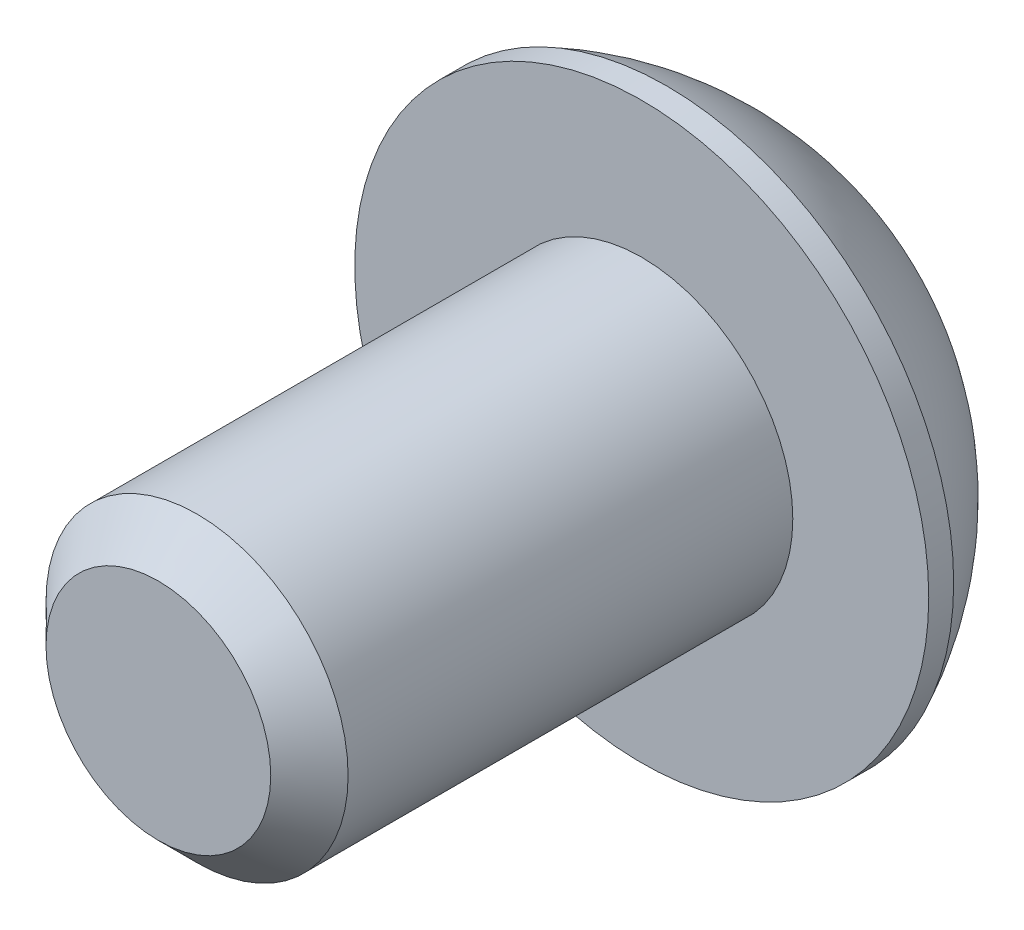
ISO-10303-21;
HEADER;
FILE_DESCRIPTION(('STEP AP214'),'2;1');
FILE_NAME('part.step','',(''),(''),'','','');
FILE_SCHEMA(('AUTOMOTIVE_DESIGN { 1 0 10303 214 1 1 1 1 }'));
ENDSEC;
DATA;
#1=APPLICATION_CONTEXT('core data for automotive mechanical design processes');
#2=APPLICATION_PROTOCOL_DEFINITION('international standard','automotive_design',2000,#1);
#3=PRODUCT_CONTEXT('',#1,'mechanical');
#4=PRODUCT('Part','Part','',(#3));
#5=PRODUCT_RELATED_PRODUCT_CATEGORY('part','',(#4));
#6=PRODUCT_DEFINITION_FORMATION('','',#4);
#7=PRODUCT_DEFINITION_CONTEXT('part definition',#1,'design');
#8=PRODUCT_DEFINITION('design','',#6,#7);
#9=PRODUCT_DEFINITION_SHAPE('','',#8);
#10=(LENGTH_UNIT() NAMED_UNIT(*) SI_UNIT(.MILLI.,.METRE.));
#11=(NAMED_UNIT(*) PLANE_ANGLE_UNIT() SI_UNIT($,.RADIAN.));
#12=(NAMED_UNIT(*) SI_UNIT($,.STERADIAN.) SOLID_ANGLE_UNIT());
#13=UNCERTAINTY_MEASURE_WITH_UNIT(LENGTH_MEASURE(1.E-05),#10,'distance_accuracy_value','');
#14=(GEOMETRIC_REPRESENTATION_CONTEXT(3) GLOBAL_UNCERTAINTY_ASSIGNED_CONTEXT((#13)) GLOBAL_UNIT_ASSIGNED_CONTEXT((#10,
#11,#12)) REPRESENTATION_CONTEXT('',''));
#15=CARTESIAN_POINT('',(0.,0.,0.));
#16=DIRECTION('',(0.,0.,1.));
#17=DIRECTION('',(1.,0.,0.));
#18=AXIS2_PLACEMENT_3D('',#15,#16,#17);
#19=CARTESIAN_POINT('',(0.,0.,-5.375));
#20=DIRECTION('',(0.,0.,1.));
#21=DIRECTION('',(-1.,0.,0.));
#22=AXIS2_PLACEMENT_3D('',#19,#20,#21);
#23=PLANE('',#22);
#24=CARTESIAN_POINT('',(0.,0.,-5.375));
#25=DIRECTION('',(0.,0.,1.));
#26=DIRECTION('',(1.,0.,0.));
#27=AXIS2_PLACEMENT_3D('',#24,#25,#26);
#28=CIRCLE('',#27,1.73205080756888);
#29=CARTESIAN_POINT('',(-1.5,0.866025403784439,-5.375));
#30=VERTEX_POINT('',#29);
#31=CARTESIAN_POINT('',(-1.5,-0.866025403784439,-5.375));
#32=VERTEX_POINT('',#31);
#33=EDGE_CURVE('E131',#30,#32,#28,.T.);
#34=ORIENTED_EDGE('',*,*,#33,.T.);
#35=CARTESIAN_POINT('',(0.,-1.73205080756888,-5.375));
#36=VERTEX_POINT('',#35);
#37=EDGE_CURVE('E142',#32,#36,#28,.T.);
#38=ORIENTED_EDGE('',*,*,#37,.T.);
#39=CARTESIAN_POINT('',(1.5,-0.866025403784439,-5.375));
#40=VERTEX_POINT('',#39);
#41=EDGE_CURVE('E141',#36,#40,#28,.T.);
#42=ORIENTED_EDGE('',*,*,#41,.T.);
#43=CARTESIAN_POINT('',(1.5,0.866025403784439,-5.375));
#44=VERTEX_POINT('',#43);
#45=EDGE_CURVE('E136',#40,#44,#28,.T.);
#46=ORIENTED_EDGE('',*,*,#45,.T.);
#47=CARTESIAN_POINT('',(0.,1.73205080756888,-5.375));
#48=VERTEX_POINT('',#47);
#49=EDGE_CURVE('E117',#44,#48,#28,.T.);
#50=ORIENTED_EDGE('',*,*,#49,.T.);
#51=EDGE_CURVE('E126',#48,#30,#28,.T.);
#52=ORIENTED_EDGE('',*,*,#51,.T.);
#53=EDGE_LOOP('',(#34,#38,#42,#46,#50,#52));
#54=FACE_BOUND('',#53,.T.);
#55=CARTESIAN_POINT('',(0.,0.,-5.375));
#56=DIRECTION('',(0.,0.,1.));
#57=DIRECTION('',(1.,0.,0.));
#58=AXIS2_PLACEMENT_3D('',#55,#56,#57);
#59=CIRCLE('',#58,2.5);
#60=CARTESIAN_POINT('',(0.,2.5,-5.375));
#61=VERTEX_POINT('',#60);
#62=EDGE_CURVE('E54',#61,#61,#59,.T.);
#63=ORIENTED_EDGE('',*,*,#62,.F.);
#64=EDGE_LOOP('',(#63));
#65=FACE_BOUND('',#64,.T.);
#66=ADVANCED_FACE('F41',(#54,#65),#23,.F.);
#67=CARTESIAN_POINT('',(0.,0.,-0.716945187165779));
#68=DIRECTION('',(0.,0.,-1.));
#69=DIRECTION('',(0.,1.,0.));
#70=AXIS2_PLACEMENT_3D('',#67,#68,#69);
#71=SPHERICAL_SURFACE('',#70,5.28653711226622);
#72=CARTESIAN_POINT('',(0.,0.,-3.0375));
#73=DIRECTION('',(0.,0.,1.));
#74=DIRECTION('',(1.,0.,0.));
#75=AXIS2_PLACEMENT_3D('',#72,#73,#74);
#76=CIRCLE('',#75,4.75);
#77=CARTESIAN_POINT('',(0.,4.75,-3.0375));
#78=VERTEX_POINT('',#77);
#79=EDGE_CURVE('E239',#78,#78,#76,.T.);
#80=CARTESIAN_POINT('',(0.,2.5,-5.375));
#81=CARTESIAN_POINT('',(0.,2.53026679982017,-5.35875571754439));
#82=CARTESIAN_POINT('',(0.,2.56037522904967,-5.34221635879359));
#83=CARTESIAN_POINT('',(0.,2.62026400427657,-5.30855394811782));
#84=CARTESIAN_POINT('',(0.,2.65004435027396,-5.29143089619285));
#85=CARTESIAN_POINT('',(0.,2.70926561698583,-5.25660755858496));
#86=CARTESIAN_POINT('',(0.,2.73870653770032,-5.23890727290205));
#87=CARTESIAN_POINT('',(0.,2.79723777417103,-5.20293620595506));
#88=CARTESIAN_POINT('',(0.,2.82632808992725,-5.18466542469098));
#89=CARTESIAN_POINT('',(0.,2.88414706107589,-5.14756030560733));
#90=CARTESIAN_POINT('',(0.,2.91287571646831,-5.12872596778776));
#91=CARTESIAN_POINT('',(0.,2.96996045130293,-5.09050089302141));
#92=CARTESIAN_POINT('',(0.,2.99831653074515,-5.07111015607464));
#93=CARTESIAN_POINT('',(0.,3.05464533901891,-5.03177965075515));
#94=CARTESIAN_POINT('',(0.,3.08261806785047,-5.01183988238244));
#95=CARTESIAN_POINT('',(0.,3.13816954607726,-4.97141889083541));
#96=CARTESIAN_POINT('',(0.,3.1657482954725,-4.9509376676611));
#97=CARTESIAN_POINT('',(0.,3.22050133565615,-4.90944154879096));
#98=CARTESIAN_POINT('',(0.,3.24767562644455,-4.88842665309514));
#99=CARTESIAN_POINT('',(0.,3.30160942393942,-4.84587117426482));
#100=CARTESIAN_POINT('',(0.,3.32836893064588,-4.82433059113033));
#101=CARTESIAN_POINT('',(0.,3.38146299210494,-4.7807319222463));
#102=CARTESIAN_POINT('',(0.,3.40779754685753,-4.75867383649676));
#103=CARTESIAN_POINT('',(0.,3.46003169800773,-4.71404854384449));
#104=CARTESIAN_POINT('',(0.,3.48593129440535,-4.69148133694177));
#105=CARTESIAN_POINT('',(0.,3.53728568771641,-4.64584637689649));
#106=CARTESIAN_POINT('',(0.,3.56274048462986,-4.62277862375395));
#107=CARTESIAN_POINT('',(0.,3.61319560685493,-4.57615133633623));
#108=CARTESIAN_POINT('',(0.,3.63819593216655,-4.55259180206105));
#109=CARTESIAN_POINT('',(0.,3.68773261175691,-4.50498990434842));
#110=CARTESIAN_POINT('',(0.,3.71226896603565,-4.48094754091097));
#111=CARTESIAN_POINT('',(0.,3.76086838042534,-4.43238912030589));
#112=CARTESIAN_POINT('',(0.,3.78493144053629,-4.40787306313825));
#113=CARTESIAN_POINT('',(0.,3.83257512329416,-4.35837657049535));
#114=CARTESIAN_POINT('',(0.,3.85615574594108,-4.33339613502009));
#115=CARTESIAN_POINT('',(0.,3.90282559378753,-4.28298037763541));
#116=CARTESIAN_POINT('',(0.,3.92591481898706,-4.25754505572599));
#117=CARTESIAN_POINT('',(0.,3.97159309867276,-4.2062291901907));
#118=CARTESIAN_POINT('',(0.,3.99418215315894,-4.18034864656483));
#119=CARTESIAN_POINT('',(0.,4.03885150820303,-4.12815217148627));
#120=CARTESIAN_POINT('',(0.,4.06093180876093,-4.10183624003358));
#121=CARTESIAN_POINT('',(0.,4.10457526604591,-4.0487789886263));
#122=CARTESIAN_POINT('',(0.,4.12613842277298,-4.0220376686717));
#123=CARTESIAN_POINT('',(0.,4.16873939899417,-3.96813980122146));
#124=CARTESIAN_POINT('',(0.,4.1897772184883,-3.94098325372581));
#125=CARTESIAN_POINT('',(0.,4.23131952645464,-3.88626524992901));
#126=CARTESIAN_POINT('',(0.,4.25182401492686,-3.85870379362786));
#127=CARTESIAN_POINT('',(0.,4.29229186971308,-3.80318644481061));
#128=CARTESIAN_POINT('',(0.,4.31225523602708,-3.7752305522945));
#129=CARTESIAN_POINT('',(0.,4.35163326096594,-3.71893495350959));
#130=CARTESIAN_POINT('',(0.,4.3710479195908,-3.6905952472408));
#131=CARTESIAN_POINT('',(0.,4.40932115213664,-3.63354278926291));
#132=CARTESIAN_POINT('',(0.,4.42817972605762,-3.60483003755382));
#133=CARTESIAN_POINT('',(0.,4.46533362339398,-3.54704239871169));
#134=CARTESIAN_POINT('',(0.,4.48362894680934,-3.51796751157864));
#135=CARTESIAN_POINT('',(0.,4.51964939166499,-3.45946664966676));
#136=CARTESIAN_POINT('',(0.,4.53737451310527,-3.43004067488792));
#137=CARTESIAN_POINT('',(0.,4.57224781803529,-3.37084881826763));
#138=CARTESIAN_POINT('',(0.,4.58939600152503,-3.34108293642618));
#139=CARTESIAN_POINT('',(0.,4.62310891815402,-3.28122257765293));
#140=CARTESIAN_POINT('',(0.,4.63967365129327,-3.25112810072113));
#141=CARTESIAN_POINT('',(0.,4.67221336026297,-3.19062198025982));
#142=CARTESIAN_POINT('',(0.,4.68818833609342,-3.16021033673031));
#143=CARTESIAN_POINT('',(0.,4.71954250823692,-3.09908146319351));
#144=CARTESIAN_POINT('',(0.,4.73492170454996,-3.06836423318622));
#145=CARTESIAN_POINT('',(0.,4.75,-3.0375));
#146=B_SPLINE_CURVE_WITH_KNOTS('',3,(#80,#81,#82,#83,#84,#85,#86,#87,#88,#89,#90,#91,#92,#93,
#94,#95,#96,#97,#98,#99,#100,#101,#102,#103,#104,#105,#106,#107,#108,#109,#110,#111,#112,#113,
#114,#115,#116,#117,#118,#119,#120,#121,#122,#123,#124,#125,#126,#127,#128,#129,#130,#131,#132,
#133,#134,#135,#136,#137,#138,#139,#140,#141,#142,#143,#144,#145),.UNSPECIFIED.,.F.,.F.,(4,2,2,
2,2,2,2,2,2,2,2,2,2,2,2,2,2,2,2,2,2,2,2,2,2,2,2,2,2,2,2,2,4),(0.,0.10304982363783,
0.206099647275661,0.309149470913491,0.412199294551322,0.515249118189152,0.618298941826983,
0.721348765464813,0.824398589102644,0.927448412740474,1.0304982363783,1.13354806001614,
1.23659788365397,1.3396477072918,1.44269753092963,1.54574735456746,1.64879717820529,
1.75184700184312,1.85489682548095,1.95794664911878,2.06099647275661,2.16404629639444,
2.26709612003227,2.3701459436701,2.47319576730793,2.57624559094576,2.67929541458359,
2.78234523822142,2.88539506185925,2.98844488549708,3.09149470913491,3.19454453277274,
3.29759435641057),.UNSPECIFIED.);
#147=EDGE_CURVE('BSEAM227',#61,#78,#146,.T.);
#148=ORIENTED_EDGE('',*,*,#62,.T.);
#149=ORIENTED_EDGE('',*,*,#79,.F.);
#150=ORIENTED_EDGE('',*,*,#147,.T.);
#151=ORIENTED_EDGE('',*,*,#147,.F.);
#152=EDGE_LOOP('',(#148,#150,#149,#151));
#153=FACE_BOUND('',#152,.T.);
#154=ADVANCED_FACE('F227',(#153),#71,.T.);
#155=CARTESIAN_POINT('',(0.,0.,-5.375));
#156=DIRECTION('',(0.,0.,-1.));
#157=DIRECTION('',(1.,0.,0.));
#158=AXIS2_PLACEMENT_3D('',#155,#156,#157);
#159=CYLINDRICAL_SURFACE('',#158,4.75);
#160=ORIENTED_EDGE('',*,*,#79,.T.);
#161=EDGE_LOOP('',(#160));
#162=FACE_BOUND('',#161,.T.);
#163=CARTESIAN_POINT('',(0.,0.,-2.625));
#164=DIRECTION('',(0.,0.,1.));
#165=DIRECTION('',(1.,0.,0.));
#166=AXIS2_PLACEMENT_3D('',#163,#164,#165);
#167=CIRCLE('',#166,4.75);
#168=CARTESIAN_POINT('',(4.75,0.,-2.625));
#169=VERTEX_POINT('',#168);
#170=EDGE_CURVE('E240',#169,#169,#167,.T.);
#171=ORIENTED_EDGE('',*,*,#170,.F.);
#172=EDGE_LOOP('',(#171));
#173=FACE_BOUND('',#172,.T.);
#174=ADVANCED_FACE('F224',(#162,#173),#159,.T.);
#175=CARTESIAN_POINT('',(0.,2.5,-2.625));
#176=DIRECTION('',(0.,0.,-1.));
#177=DIRECTION('',(1.,0.,0.));
#178=AXIS2_PLACEMENT_3D('',#175,#176,#177);
#179=PLANE('',#178);
#180=ORIENTED_EDGE('',*,*,#170,.T.);
#181=EDGE_LOOP('',(#180));
#182=FACE_BOUND('',#181,.T.);
#183=CARTESIAN_POINT('',(0.,0.,-2.625));
#184=DIRECTION('',(0.,0.,1.));
#185=DIRECTION('',(1.,0.,0.));
#186=AXIS2_PLACEMENT_3D('',#183,#184,#185);
#187=CIRCLE('',#186,2.5);
#188=CARTESIAN_POINT('',(2.5,0.,-2.625));
#189=VERTEX_POINT('',#188);
#190=EDGE_CURVE('E243',#189,#189,#187,.T.);
#191=ORIENTED_EDGE('',*,*,#190,.F.);
#192=EDGE_LOOP('',(#191));
#193=FACE_BOUND('',#192,.T.);
#194=ADVANCED_FACE('F220',(#182,#193),#179,.F.);
#195=CARTESIAN_POINT('',(0.,0.,-5.375));
#196=DIRECTION('',(0.,0.,-1.));
#197=DIRECTION('',(1.,0.,0.));
#198=AXIS2_PLACEMENT_3D('',#195,#196,#197);
#199=CYLINDRICAL_SURFACE('',#198,2.5);
#200=ORIENTED_EDGE('',*,*,#190,.T.);
#201=EDGE_LOOP('',(#200));
#202=FACE_BOUND('',#201,.T.);
#203=CARTESIAN_POINT('',(0.,0.,4.735));
#204=DIRECTION('',(0.,0.,1.));
#205=DIRECTION('',(1.,0.,0.));
#206=AXIS2_PLACEMENT_3D('',#203,#204,#205);
#207=CIRCLE('',#206,2.5);
#208=CARTESIAN_POINT('',(2.5,0.,4.735));
#209=VERTEX_POINT('',#208);
#210=EDGE_CURVE('E248',#209,#209,#207,.T.);
#211=ORIENTED_EDGE('',*,*,#210,.F.);
#212=EDGE_LOOP('',(#211));
#213=FACE_BOUND('',#212,.T.);
#214=ADVANCED_FACE('F216',(#202,#213),#199,.T.);
#215=CARTESIAN_POINT('',(0.,0.,5.375));
#216=DIRECTION('',(0.,0.,-1.));
#217=DIRECTION('',(1.,0.,0.));
#218=AXIS2_PLACEMENT_3D('',#215,#216,#217);
#219=CONICAL_SURFACE('',#218,1.86000000000001,0.785398163397443);
#220=ORIENTED_EDGE('',*,*,#210,.T.);
#221=EDGE_LOOP('',(#220));
#222=FACE_BOUND('',#221,.T.);
#223=CARTESIAN_POINT('',(0.,0.,5.375));
#224=DIRECTION('',(0.,0.,1.));
#225=DIRECTION('',(1.,0.,0.));
#226=AXIS2_PLACEMENT_3D('',#223,#224,#225);
#227=CIRCLE('',#226,1.86000000000001);
#228=CARTESIAN_POINT('',(1.86000000000001,0.,5.375));
#229=VERTEX_POINT('',#228);
#230=EDGE_CURVE('E251',#229,#229,#227,.T.);
#231=ORIENTED_EDGE('',*,*,#230,.F.);
#232=EDGE_LOOP('',(#231));
#233=FACE_BOUND('',#232,.T.);
#234=ADVANCED_FACE('F212',(#222,#233),#219,.T.);
#235=CARTESIAN_POINT('',(0.,0.,5.375));
#236=DIRECTION('',(0.,0.,-1.));
#237=DIRECTION('',(1.,0.,0.));
#238=AXIS2_PLACEMENT_3D('',#235,#236,#237);
#239=PLANE('',#238);
#240=ORIENTED_EDGE('',*,*,#230,.T.);
#241=EDGE_LOOP('',(#240));
#242=FACE_BOUND('',#241,.T.);
#243=ADVANCED_FACE('F209',(#242),#239,.F.);
#244=CARTESIAN_POINT('',(0.,0.,-5.375));
#245=DIRECTION('',(0.,0.,-1.));
#246=DIRECTION('',(1.,0.,0.));
#247=AXIS2_PLACEMENT_3D('',#244,#245,#246);
#248=CONICAL_SURFACE('',#247,1.73205080756888,0.78539816339745);
#249=ORIENTED_EDGE('',*,*,#51,.F.);
#250=CARTESIAN_POINT('',(0.000199999999999762,1.73216627762272,-5.37511548160007));
#251=CARTESIAN_POINT('',(-0.0513677907370759,1.70239359975915,-5.34536547606733));
#252=CARTESIAN_POINT('',(-0.103797917665201,1.67212305186355,-5.31736248391031));
#253=CARTESIAN_POINT('',(-0.210709034055597,1.61039789003619,-5.26608923044014));
#254=CARTESIAN_POINT('',(-0.265200195814661,1.57893740312614,-5.24284750504437));
#255=CARTESIAN_POINT('',(-0.375079081357249,1.51549879897987,-5.20303372899222));
#256=CARTESIAN_POINT('',(-0.4304388090952,1.4835368452681,-5.1863615856709));
#257=CARTESIAN_POINT('',(-0.54237725747715,1.41890915196211,-5.1606744568181));
#258=CARTESIAN_POINT('',(-0.598952556553008,1.38624538781118,-5.15164029047887));
#259=CARTESIAN_POINT('',(-0.696455389516441,1.329952100953,-5.14348908122685));
#260=CARTESIAN_POINT('',(-0.737256908280466,1.30639533311124,-5.14228225298922));
#261=CARTESIAN_POINT('',(-0.818787969615858,1.25932335290194,-5.14431405716227));
#262=CARTESIAN_POINT('',(-0.85951749431463,1.23580815085313,-5.14755367074831));
#263=CARTESIAN_POINT('',(-0.940584402163416,1.18900414978427,-5.15829198598196));
#264=CARTESIAN_POINT('',(-0.980921384598288,1.1657155821172,-5.16579465301873));
#265=CARTESIAN_POINT('',(-1.06091833691403,1.11952932016335,-5.18465161192829));
#266=CARTESIAN_POINT('',(-1.10057800851621,1.09663179808786,-5.19600755701859));
#267=CARTESIAN_POINT('',(-1.20216313477448,1.03798159809698,-5.22972164759267));
#268=CARTESIAN_POINT('',(-1.26345855370969,1.00259267147465,-5.25462184909337));
#269=CARTESIAN_POINT('',(-1.35358562846331,0.950557780604375,-5.29665665327158));
#270=CARTESIAN_POINT('',(-1.38328513990772,0.933410759677148,-5.3114251535591));
#271=CARTESIAN_POINT('',(-1.44213790138375,0.899432101996407,-5.34231056594017));
#272=CARTESIAN_POINT('',(-1.47129140422064,0.882600319285711,-5.35842683412171));
#273=CARTESIAN_POINT('',(-1.5002,0.865909933730602,-5.37511548160007));
#274=B_SPLINE_CURVE_WITH_KNOTS('',3,(#250,#251,#252,#253,#254,#255,#256,#257,#258,#259,#260,
#261,#262,#263,#264,#265,#266,#267,#268,#269,#270,#271,#272,#273),.UNSPECIFIED.,.F.,.F.,(4,2,2,
2,2,2,2,2,2,2,2,4),(0.,0.199829143693305,0.400822987382388,0.59862372053818,0.795926240188888,
0.93711306795988,1.07833105577193,1.21968061668222,1.36109089931054,1.58570969637565,
1.69770705470964,1.80965120737194),.UNSPECIFIED.);
#275=EDGE_CURVE('E11',#48,#30,#274,.T.);
#276=ORIENTED_EDGE('',*,*,#275,.T.);
#277=EDGE_LOOP('',(#249,#276));
#278=FACE_BOUND('',#277,.T.);
#279=ADVANCED_FACE('F127',(#278),#248,.F.);
#280=ORIENTED_EDGE('',*,*,#33,.F.);
#281=CARTESIAN_POINT('',(-1.5,-1.72720812969692,-5.93057851627079));
#282=CARTESIAN_POINT('',(-1.5,-1.68515175699268,-5.89882990785743));
#283=CARTESIAN_POINT('',(-1.5,-1.64286104748673,-5.86739259380738));
#284=CARTESIAN_POINT('',(-1.5,-1.55771581035942,-5.80526908755641));
#285=CARTESIAN_POINT('',(-1.5,-1.51486114386668,-5.7745830858922));
#286=CARTESIAN_POINT('',(-1.5,-1.3846813415127,-5.68340719242716));
#287=CARTESIAN_POINT('',(-1.5,-1.29637976071654,-5.62428834342677));
#288=CARTESIAN_POINT('',(-1.5,-1.11121478730467,-5.5082309963165));
#289=CARTESIAN_POINT('',(-1.5,-1.01415038238167,-5.45160955873301));
#290=CARTESIAN_POINT('',(-1.5,-0.815173408897605,-5.34803688126565));
#291=CARTESIAN_POINT('',(-1.5,-0.713278669253285,-5.30105304154167));
#292=CARTESIAN_POINT('',(-1.5,-0.560333774943111,-5.24357266843083));
#293=CARTESIAN_POINT('',(-1.5,-0.511547982948042,-5.22707538775725));
#294=CARTESIAN_POINT('',(-1.5,-0.412798620136866,-5.19799751292701));
#295=CARTESIAN_POINT('',(-1.5,-0.362834968437562,-5.18541718859402));
#296=CARTESIAN_POINT('',(-1.5,-0.262863235444981,-5.16503619414677));
#297=CARTESIAN_POINT('',(-1.5,-0.212872113808022,-5.15715363274598));
#298=CARTESIAN_POINT('',(-1.5,-0.112355243569545,-5.146322063969));
#299=CARTESIAN_POINT('',(-1.5,-0.0618295883726273,-5.14337220852435));
#300=CARTESIAN_POINT('',(-1.5,0.0374291733323846,-5.14262485772485));
#301=CARTESIAN_POINT('',(-1.5,0.0861609672002995,-5.14464473355808));
#302=CARTESIAN_POINT('',(-1.5,0.183206937768827,-5.15332255289676));
#303=CARTESIAN_POINT('',(-1.5,0.231521073438269,-5.15998094696846));
#304=CARTESIAN_POINT('',(-1.5,0.328199853425436,-5.17768524412257));
#305=CARTESIAN_POINT('',(-1.5,0.376550616310328,-5.18880581125704));
#306=CARTESIAN_POINT('',(-1.5,0.472195697125599,-5.21484341404871));
#307=CARTESIAN_POINT('',(-1.5,0.519490103092741,-5.22976013204094));
#308=CARTESIAN_POINT('',(-1.5,0.668391282696625,-5.28233522359607));
#309=CARTESIAN_POINT('',(-1.5,0.767878709508553,-5.32598128747198));
#310=CARTESIAN_POINT('',(-1.5,0.962179866690724,-5.4230229945931));
#311=CARTESIAN_POINT('',(-1.5,1.05697519961444,-5.47645366508953));
#312=CARTESIAN_POINT('',(-1.5,1.23814273533383,-5.58668585200456));
#313=CARTESIAN_POINT('',(-1.5,1.3246994218129,-5.6431879206986));
#314=CARTESIAN_POINT('',(-1.5,1.45222331290673,-5.73053430157866));
#315=CARTESIAN_POINT('',(-1.5,1.49418091978756,-5.75995775868004));
#316=CARTESIAN_POINT('',(-1.5,1.57752272931476,-5.81958282183046));
#317=CARTESIAN_POINT('',(-1.5,1.61890708647354,-5.84978421166444));
#318=CARTESIAN_POINT('',(-1.5,1.66005278019494,-5.88030817860946));
#319=B_SPLINE_CURVE_WITH_KNOTS('',3,(#281,#282,#283,#284,#285,#286,#287,#288,#289,#290,#291,
#292,#293,#294,#295,#296,#297,#298,#299,#300,#301,#302,#303,#304,#305,#306,#307,#308,#309,#310,
#311,#312,#313,#314,#315,#316,#317,#318),.UNSPECIFIED.,.F.,.F.,(4,2,2,2,2,2,2,2,2,2,2,2,2,2,2,2,
2,2,4),(0.,0.158079548982669,0.316198780993942,0.634850417346958,0.971690311361509,
1.30737131660667,1.46173961127088,1.61611853740677,1.76772101421409,1.91929742368538,
2.065387412096,2.21149159305544,2.36014984633872,2.50879566386709,2.83376031422673,
3.15991186985652,3.46985601802197,3.62358896039974,3.7772796264207),.UNSPECIFIED.);
#320=EDGE_CURVE('E137',#30,#32,#319,.F.);
#321=ORIENTED_EDGE('',*,*,#320,.T.);
#322=EDGE_LOOP('',(#280,#321));
#323=FACE_BOUND('',#322,.T.);
#324=ADVANCED_FACE('F147',(#323),#248,.F.);
#325=ORIENTED_EDGE('',*,*,#37,.F.);
#326=CARTESIAN_POINT('',(-1.5002,-0.865909933730601,-5.37511548160007));
#327=CARTESIAN_POINT('',(-1.44863220926292,-0.895682611594166,-5.34536547606733));
#328=CARTESIAN_POINT('',(-1.3962020823348,-0.925953159489765,-5.31736248391031));
#329=CARTESIAN_POINT('',(-1.2892909659444,-0.987678321317123,-5.26608923044014));
#330=CARTESIAN_POINT('',(-1.23479980418534,-1.01913880822717,-5.24284750504437));
#331=CARTESIAN_POINT('',(-1.12492091864275,-1.08257741237344,-5.20303372899222));
#332=CARTESIAN_POINT('',(-1.0695611909048,-1.11453936608521,-5.1863615856709));
#333=CARTESIAN_POINT('',(-0.957622742522849,-1.1791670593912,-5.1606744568181));
#334=CARTESIAN_POINT('',(-0.901047443446991,-1.21183082354213,-5.15164029047887));
#335=CARTESIAN_POINT('',(-0.803544610483559,-1.26812411040032,-5.14348908122685));
#336=CARTESIAN_POINT('',(-0.762743091719534,-1.29168087824208,-5.14228225298922));
#337=CARTESIAN_POINT('',(-0.681212030384142,-1.33875285845138,-5.14431405716227));
#338=CARTESIAN_POINT('',(-0.64048250568537,-1.36226806050018,-5.14755367074831));
#339=CARTESIAN_POINT('',(-0.559415597836584,-1.40907206156905,-5.15829198598196));
#340=CARTESIAN_POINT('',(-0.519078615401712,-1.43236062923612,-5.16579465301873));
#341=CARTESIAN_POINT('',(-0.439081663085969,-1.47854689118996,-5.18465161192829));
#342=CARTESIAN_POINT('',(-0.399421991483792,-1.50144441326545,-5.19600755701859));
#343=CARTESIAN_POINT('',(-0.297836865225515,-1.56009461325633,-5.22972164759267));
#344=CARTESIAN_POINT('',(-0.236541446290311,-1.59548353987866,-5.25462184909337));
#345=CARTESIAN_POINT('',(-0.146414371536686,-1.64751843074894,-5.29665665327158));
#346=CARTESIAN_POINT('',(-0.116714860092282,-1.66466545167617,-5.3114251535591));
#347=CARTESIAN_POINT('',(-0.057862098616249,-1.69864410935691,-5.34231056594017));
#348=CARTESIAN_POINT('',(-0.0287085957793628,-1.71547589206761,-5.35842683412171));
#349=CARTESIAN_POINT('',(0.000199999999999948,-1.73216627762272,-5.37511548160007));
#350=B_SPLINE_CURVE_WITH_KNOTS('',3,(#326,#327,#328,#329,#330,#331,#332,#333,#334,#335,#336,
#337,#338,#339,#340,#341,#342,#343,#344,#345,#346,#347,#348,#349),.UNSPECIFIED.,.F.,.F.,(4,2,2,
2,2,2,2,2,2,2,2,4),(0.,0.199829143693305,0.400822987382388,0.59862372053818,0.795926240188889,
0.937113067959881,1.07833105577193,1.21968061668222,1.36109089931054,1.58570969637565,
1.69770705470964,1.80965120737194),.UNSPECIFIED.);
#351=EDGE_CURVE('E139',#32,#36,#350,.T.);
#352=ORIENTED_EDGE('',*,*,#351,.T.);
#353=EDGE_LOOP('',(#325,#352));
#354=FACE_BOUND('',#353,.T.);
#355=ADVANCED_FACE('F151',(#354),#248,.F.);
#356=ORIENTED_EDGE('',*,*,#41,.F.);
#357=CARTESIAN_POINT('',(-0.000200000000000055,-1.73216627762271,-5.37511548160007));
#358=CARTESIAN_POINT('',(0.0513677907370757,-1.70239359975915,-5.34536547606733));
#359=CARTESIAN_POINT('',(0.103797917665201,-1.67212305186355,-5.31736248391031));
#360=CARTESIAN_POINT('',(0.210709034055597,-1.61039789003619,-5.26608923044014));
#361=CARTESIAN_POINT('',(0.265200195814661,-1.57893740312614,-5.24284750504437));
#362=CARTESIAN_POINT('',(0.375079081357248,-1.51549879897987,-5.20303372899222));
#363=CARTESIAN_POINT('',(0.430438809095199,-1.4835368452681,-5.1863615856709));
#364=CARTESIAN_POINT('',(0.54237725747715,-1.41890915196211,-5.1606744568181));
#365=CARTESIAN_POINT('',(0.598952556553008,-1.38624538781118,-5.15164029047887));
#366=CARTESIAN_POINT('',(0.69645538951644,-1.32995210095299,-5.14348908122685));
#367=CARTESIAN_POINT('',(0.737256908280466,-1.30639533311124,-5.14228225298922));
#368=CARTESIAN_POINT('',(0.818787969615858,-1.25932335290193,-5.14431405716227));
#369=CARTESIAN_POINT('',(0.859517494314629,-1.23580815085313,-5.14755367074831));
#370=CARTESIAN_POINT('',(0.940584402163416,-1.18900414978427,-5.15829198598196));
#371=CARTESIAN_POINT('',(0.980921384598288,-1.1657155821172,-5.16579465301873));
#372=CARTESIAN_POINT('',(1.06091833691403,-1.11952932016335,-5.18465161192829));
#373=CARTESIAN_POINT('',(1.10057800851621,-1.09663179808786,-5.19600755701859));
#374=CARTESIAN_POINT('',(1.20216313477448,-1.03798159809698,-5.22972164759267));
#375=CARTESIAN_POINT('',(1.26345855370969,-1.00259267147465,-5.25462184909337));
#376=CARTESIAN_POINT('',(1.35358562846331,-0.950557780604375,-5.29665665327158));
#377=CARTESIAN_POINT('',(1.38328513990772,-0.933410759677148,-5.3114251535591));
#378=CARTESIAN_POINT('',(1.44213790138375,-0.899432101996407,-5.34231056594017));
#379=CARTESIAN_POINT('',(1.47129140422064,-0.88260031928571,-5.35842683412171));
#380=CARTESIAN_POINT('',(1.5002,-0.865909933730601,-5.37511548160007));
#381=B_SPLINE_CURVE_WITH_KNOTS('',3,(#357,#358,#359,#360,#361,#362,#363,#364,#365,#366,#367,
#368,#369,#370,#371,#372,#373,#374,#375,#376,#377,#378,#379,#380),.UNSPECIFIED.,.F.,.F.,(4,2,2,
2,2,2,2,2,2,2,2,4),(0.,0.199829143693305,0.400822987382388,0.59862372053818,0.795926240188889,
0.93711306795988,1.07833105577193,1.21968061668222,1.36109089931054,1.58570969637565,
1.69770705470963,1.80965120737194),.UNSPECIFIED.);
#382=EDGE_CURVE('E154',#36,#40,#381,.T.);
#383=ORIENTED_EDGE('',*,*,#382,.T.);
#384=EDGE_LOOP('',(#356,#383));
#385=FACE_BOUND('',#384,.T.);
#386=ADVANCED_FACE('F158',(#385),#248,.F.);
#387=ORIENTED_EDGE('',*,*,#45,.F.);
#388=CARTESIAN_POINT('',(1.5,-1.72720812969693,-5.93057851627079));
#389=CARTESIAN_POINT('',(1.5,-1.68515175699268,-5.89882990785743));
#390=CARTESIAN_POINT('',(1.5,-1.64286104748674,-5.86739259380738));
#391=CARTESIAN_POINT('',(1.5,-1.55771581035942,-5.80526908755641));
#392=CARTESIAN_POINT('',(1.5,-1.51486114386668,-5.7745830858922));
#393=CARTESIAN_POINT('',(1.5,-1.3846813415127,-5.68340719242716));
#394=CARTESIAN_POINT('',(1.5,-1.29637976071654,-5.62428834342677));
#395=CARTESIAN_POINT('',(1.5,-1.11121478730467,-5.50823099631651));
#396=CARTESIAN_POINT('',(1.5,-1.01415038238167,-5.45160955873301));
#397=CARTESIAN_POINT('',(1.5,-0.815173408897606,-5.34803688126565));
#398=CARTESIAN_POINT('',(1.5,-0.713278669253286,-5.30105304154167));
#399=CARTESIAN_POINT('',(1.5,-0.560333774943112,-5.24357266843083));
#400=CARTESIAN_POINT('',(1.5,-0.511547982948042,-5.22707538775725));
#401=CARTESIAN_POINT('',(1.5,-0.412798620136867,-5.19799751292701));
#402=CARTESIAN_POINT('',(1.5,-0.362834968437563,-5.18541718859402));
#403=CARTESIAN_POINT('',(1.5,-0.262863235444982,-5.16503619414677));
#404=CARTESIAN_POINT('',(1.5,-0.212872113808023,-5.15715363274598));
#405=CARTESIAN_POINT('',(1.5,-0.112355243569545,-5.146322063969));
#406=CARTESIAN_POINT('',(1.5,-0.061829588372628,-5.14337220852435));
#407=CARTESIAN_POINT('',(1.5,0.0374291733323839,-5.14262485772485));
#408=CARTESIAN_POINT('',(1.5,0.0861609672002987,-5.14464473355808));
#409=CARTESIAN_POINT('',(1.5,0.183206937768827,-5.15332255289676));
#410=CARTESIAN_POINT('',(1.5,0.231521073438269,-5.15998094696846));
#411=CARTESIAN_POINT('',(1.5,0.328199853425435,-5.17768524412257));
#412=CARTESIAN_POINT('',(1.5,0.376550616310327,-5.18880581125704));
#413=CARTESIAN_POINT('',(1.5,0.472195697125598,-5.21484341404871));
#414=CARTESIAN_POINT('',(1.5,0.51949010309274,-5.22976013204094));
#415=CARTESIAN_POINT('',(1.5,0.668391282696624,-5.28233522359607));
#416=CARTESIAN_POINT('',(1.5,0.767878709508552,-5.32598128747198));
#417=CARTESIAN_POINT('',(1.5,0.962179866690723,-5.4230229945931));
#418=CARTESIAN_POINT('',(1.5,1.05697519961444,-5.47645366508953));
#419=CARTESIAN_POINT('',(1.5,1.23814273533383,-5.58668585200456));
#420=CARTESIAN_POINT('',(1.5,1.3246994218129,-5.6431879206986));
#421=CARTESIAN_POINT('',(1.5,1.45222331290673,-5.73053430157866));
#422=CARTESIAN_POINT('',(1.5,1.49418091978756,-5.75995775868004));
#423=CARTESIAN_POINT('',(1.5,1.57752272931476,-5.81958282183046));
#424=CARTESIAN_POINT('',(1.5,1.61890708647354,-5.84978421166444));
#425=CARTESIAN_POINT('',(1.5,1.66005278019494,-5.88030817860946));
#426=B_SPLINE_CURVE_WITH_KNOTS('',3,(#388,#389,#390,#391,#392,#393,#394,#395,#396,#397,#398,
#399,#400,#401,#402,#403,#404,#405,#406,#407,#408,#409,#410,#411,#412,#413,#414,#415,#416,#417,
#418,#419,#420,#421,#422,#423,#424,#425),.UNSPECIFIED.,.F.,.F.,(4,2,2,2,2,2,2,2,2,2,2,2,2,2,2,2,
2,2,4),(0.,0.158079548982669,0.316198780993942,0.634850417346958,0.97169031136151,
1.30737131660667,1.46173961127089,1.61611853740677,1.7677210142141,1.91929742368538,
2.065387412096,2.21149159305544,2.36014984633872,2.50879566386709,2.83376031422673,
3.15991186985652,3.46985601802197,3.62358896039974,3.7772796264207),.UNSPECIFIED.);
#427=EDGE_CURVE('E119',#40,#44,#426,.T.);
#428=ORIENTED_EDGE('',*,*,#427,.T.);
#429=EDGE_LOOP('',(#387,#428));
#430=FACE_BOUND('',#429,.T.);
#431=ADVANCED_FACE('F161',(#430),#248,.F.);
#432=ORIENTED_EDGE('',*,*,#49,.F.);
#433=CARTESIAN_POINT('',(1.5002,0.865909933730601,-5.37511548160007));
#434=CARTESIAN_POINT('',(1.44863220926292,0.895682611594166,-5.34536547606733));
#435=CARTESIAN_POINT('',(1.3962020823348,0.925953159489765,-5.31736248391031));
#436=CARTESIAN_POINT('',(1.2892909659444,0.987678321317124,-5.26608923044014));
#437=CARTESIAN_POINT('',(1.23479980418534,1.01913880822717,-5.24284750504437));
#438=CARTESIAN_POINT('',(1.12492091864275,1.08257741237344,-5.20303372899222));
#439=CARTESIAN_POINT('',(1.0695611909048,1.11453936608521,-5.1863615856709));
#440=CARTESIAN_POINT('',(0.957622742522849,1.1791670593912,-5.1606744568181));
#441=CARTESIAN_POINT('',(0.901047443446991,1.21183082354213,-5.15164029047887));
#442=CARTESIAN_POINT('',(0.803544610483559,1.26812411040032,-5.14348908122685));
#443=CARTESIAN_POINT('',(0.762743091719533,1.29168087824208,-5.14228225298922));
#444=CARTESIAN_POINT('',(0.681212030384141,1.33875285845138,-5.14431405716227));
#445=CARTESIAN_POINT('',(0.64048250568537,1.36226806050018,-5.14755367074831));
#446=CARTESIAN_POINT('',(0.559415597836584,1.40907206156905,-5.15829198598196));
#447=CARTESIAN_POINT('',(0.519078615401711,1.43236062923612,-5.16579465301873));
#448=CARTESIAN_POINT('',(0.439081663085969,1.47854689118996,-5.18465161192829));
#449=CARTESIAN_POINT('',(0.399421991483792,1.50144441326545,-5.19600755701859));
#450=CARTESIAN_POINT('',(0.297836865225515,1.56009461325633,-5.22972164759267));
#451=CARTESIAN_POINT('',(0.236541446290311,1.59548353987866,-5.25462184909337));
#452=CARTESIAN_POINT('',(0.146414371536686,1.64751843074894,-5.29665665327158));
#453=CARTESIAN_POINT('',(0.116714860092282,1.66466545167617,-5.3114251535591));
#454=CARTESIAN_POINT('',(0.0578620986162487,1.69864410935691,-5.34231056594017));
#455=CARTESIAN_POINT('',(0.0287085957793624,1.71547589206761,-5.35842683412171));
#456=CARTESIAN_POINT('',(-0.000200000000000159,1.73216627762272,-5.37511548160007));
#457=B_SPLINE_CURVE_WITH_KNOTS('',3,(#433,#434,#435,#436,#437,#438,#439,#440,#441,#442,#443,
#444,#445,#446,#447,#448,#449,#450,#451,#452,#453,#454,#455,#456),.UNSPECIFIED.,.F.,.F.,(4,2,2,
2,2,2,2,2,2,2,2,4),(0.,0.199829143693304,0.400822987382389,0.598623720538181,0.795926240188889,
0.937113067959881,1.07833105577193,1.21968061668222,1.36109089931054,1.58570969637565,
1.69770705470964,1.80965120737194),.UNSPECIFIED.);
#458=EDGE_CURVE('E102',#44,#48,#457,.T.);
#459=ORIENTED_EDGE('',*,*,#458,.T.);
#460=EDGE_LOOP('',(#432,#459));
#461=FACE_BOUND('',#460,.T.);
#462=ADVANCED_FACE('F115',(#461),#248,.F.);
#463=CARTESIAN_POINT('',(0.,0.,-3.275));
#464=DIRECTION('',(0.,0.,-1.));
#465=DIRECTION('',(1.,0.,0.));
#466=AXIS2_PLACEMENT_3D('',#463,#464,#465);
#467=PLANE('',#466);
#468=DIRECTION('',(-0.866025403784439,0.5,0.));
#469=VECTOR('',#468,1.);
#470=CARTESIAN_POINT('',(1.5,0.866025403784439,-3.275));
#471=LINE('',#470,#469);
#472=CARTESIAN_POINT('',(1.5,0.866025403784439,-3.275));
#473=VERTEX_POINT('',#472);
#474=CARTESIAN_POINT('',(0.,1.73205080756888,-3.275));
#475=VERTEX_POINT('',#474);
#476=EDGE_CURVE('E105',#473,#475,#471,.T.);
#477=ORIENTED_EDGE('',*,*,#476,.F.);
#478=DIRECTION('',(0.,1.,0.));
#479=VECTOR('',#478,1.);
#480=CARTESIAN_POINT('',(1.5,-0.866025403784439,-3.275));
#481=LINE('',#480,#479);
#482=CARTESIAN_POINT('',(1.5,-0.866025403784439,-3.275));
#483=VERTEX_POINT('',#482);
#484=EDGE_CURVE('E111',#483,#473,#481,.T.);
#485=ORIENTED_EDGE('',*,*,#484,.F.);
#486=DIRECTION('',(0.866025403784439,0.5,0.));
#487=VECTOR('',#486,1.);
#488=CARTESIAN_POINT('',(0.,-1.73205080756888,-3.275));
#489=LINE('',#488,#487);
#490=CARTESIAN_POINT('',(0.,-1.73205080756888,-3.275));
#491=VERTEX_POINT('',#490);
#492=EDGE_CURVE('E262',#491,#483,#489,.T.);
#493=ORIENTED_EDGE('',*,*,#492,.F.);
#494=DIRECTION('',(0.866025403784439,-0.5,0.));
#495=VECTOR('',#494,1.);
#496=CARTESIAN_POINT('',(-1.5,-0.866025403784438,-3.275));
#497=LINE('',#496,#495);
#498=CARTESIAN_POINT('',(-1.5,-0.866025403784438,-3.275));
#499=VERTEX_POINT('',#498);
#500=EDGE_CURVE('E264',#499,#491,#497,.T.);
#501=ORIENTED_EDGE('',*,*,#500,.F.);
#502=DIRECTION('',(0.,-1.,0.));
#503=VECTOR('',#502,1.);
#504=CARTESIAN_POINT('',(-1.5,0.866025403784439,-3.275));
#505=LINE('',#504,#503);
#506=CARTESIAN_POINT('',(-1.5,0.866025403784439,-3.275));
#507=VERTEX_POINT('',#506);
#508=EDGE_CURVE('E267',#507,#499,#505,.T.);
#509=ORIENTED_EDGE('',*,*,#508,.F.);
#510=DIRECTION('',(-0.866025403784439,-0.5,0.));
#511=VECTOR('',#510,1.);
#512=CARTESIAN_POINT('',(0.,1.73205080756888,-3.275));
#513=LINE('',#512,#511);
#514=EDGE_CURVE('E270',#475,#507,#513,.T.);
#515=ORIENTED_EDGE('',*,*,#514,.F.);
#516=EDGE_LOOP('',(#477,#485,#493,#501,#509,#515));
#517=FACE_BOUND('',#516,.T.);
#518=ADVANCED_FACE('F185',(#517),#467,.T.);
#519=CARTESIAN_POINT('',(0.,1.73205080756888,-3.275));
#520=DIRECTION('',(-0.5,0.866025403784439,0.));
#521=DIRECTION('',(-0.866025403784439,-0.5,0.));
#522=AXIS2_PLACEMENT_3D('',#519,#520,#521);
#523=PLANE('',#522);
#524=DIRECTION('',(0.,0.,-1.));
#525=VECTOR('',#524,1.);
#526=CARTESIAN_POINT('',(0.,1.73205080756888,-3.275));
#527=LINE('',#526,#525);
#528=EDGE_CURVE('E99',#475,#48,#527,.T.);
#529=ORIENTED_EDGE('',*,*,#528,.F.);
#530=ORIENTED_EDGE('',*,*,#514,.T.);
#531=DIRECTION('',(0.,0.,-1.));
#532=VECTOR('',#531,1.);
#533=CARTESIAN_POINT('',(-1.5,0.866025403784439,-3.275));
#534=LINE('',#533,#532);
#535=EDGE_CURVE('E110',#507,#30,#534,.T.);
#536=ORIENTED_EDGE('',*,*,#535,.T.);
#537=ORIENTED_EDGE('',*,*,#275,.F.);
#538=EDGE_LOOP('',(#529,#530,#536,#537));
#539=FACE_BOUND('',#538,.T.);
#540=ADVANCED_FACE('F122',(#539),#523,.F.);
#541=CARTESIAN_POINT('',(-1.5,0.866025403784439,-3.275));
#542=DIRECTION('',(-1.,0.,0.));
#543=DIRECTION('',(0.,0.,-1.));
#544=AXIS2_PLACEMENT_3D('',#541,#542,#543);
#545=PLANE('',#544);
#546=ORIENTED_EDGE('',*,*,#535,.F.);
#547=ORIENTED_EDGE('',*,*,#508,.T.);
#548=DIRECTION('',(0.,0.,-1.));
#549=VECTOR('',#548,1.);
#550=CARTESIAN_POINT('',(-1.5,-0.866025403784438,-3.275));
#551=LINE('',#550,#549);
#552=EDGE_CURVE('E255',#499,#32,#551,.T.);
#553=ORIENTED_EDGE('',*,*,#552,.T.);
#554=ORIENTED_EDGE('',*,*,#320,.F.);
#555=EDGE_LOOP('',(#546,#547,#553,#554));
#556=FACE_BOUND('',#555,.T.);
#557=ADVANCED_FACE('F193',(#556),#545,.F.);
#558=CARTESIAN_POINT('',(-1.5,-0.866025403784438,-3.275));
#559=DIRECTION('',(-0.5,-0.866025403784439,0.));
#560=DIRECTION('',(0.866025403784439,-0.5,0.));
#561=AXIS2_PLACEMENT_3D('',#558,#559,#560);
#562=PLANE('',#561);
#563=ORIENTED_EDGE('',*,*,#552,.F.);
#564=ORIENTED_EDGE('',*,*,#500,.T.);
#565=DIRECTION('',(0.,0.,-1.));
#566=VECTOR('',#565,1.);
#567=CARTESIAN_POINT('',(0.,-1.73205080756888,-3.275));
#568=LINE('',#567,#566);
#569=EDGE_CURVE('E257',#491,#36,#568,.T.);
#570=ORIENTED_EDGE('',*,*,#569,.T.);
#571=ORIENTED_EDGE('',*,*,#351,.F.);
#572=EDGE_LOOP('',(#563,#564,#570,#571));
#573=FACE_BOUND('',#572,.T.);
#574=ADVANCED_FACE('F189',(#573),#562,.F.);
#575=CARTESIAN_POINT('',(0.,-1.73205080756888,-3.275));
#576=DIRECTION('',(0.5,-0.866025403784439,0.));
#577=DIRECTION('',(0.866025403784439,0.5,0.));
#578=AXIS2_PLACEMENT_3D('',#575,#576,#577);
#579=PLANE('',#578);
#580=ORIENTED_EDGE('',*,*,#569,.F.);
#581=ORIENTED_EDGE('',*,*,#492,.T.);
#582=DIRECTION('',(0.,0.,-1.));
#583=VECTOR('',#582,1.);
#584=CARTESIAN_POINT('',(1.5,-0.866025403784439,-3.275));
#585=LINE('',#584,#583);
#586=EDGE_CURVE('E69',#483,#40,#585,.T.);
#587=ORIENTED_EDGE('',*,*,#586,.T.);
#588=ORIENTED_EDGE('',*,*,#382,.F.);
#589=EDGE_LOOP('',(#580,#581,#587,#588));
#590=FACE_BOUND('',#589,.T.);
#591=ADVANCED_FACE('F184',(#590),#579,.F.);
#592=CARTESIAN_POINT('',(1.5,-0.866025403784439,-3.275));
#593=DIRECTION('',(1.,0.,0.));
#594=DIRECTION('',(0.,1.,0.));
#595=AXIS2_PLACEMENT_3D('',#592,#593,#594);
#596=PLANE('',#595);
#597=ORIENTED_EDGE('',*,*,#586,.F.);
#598=ORIENTED_EDGE('',*,*,#484,.T.);
#599=DIRECTION('',(0.,0.,-1.));
#600=VECTOR('',#599,1.);
#601=CARTESIAN_POINT('',(1.5,0.866025403784439,-3.275));
#602=LINE('',#601,#600);
#603=EDGE_CURVE('E61',#473,#44,#602,.T.);
#604=ORIENTED_EDGE('',*,*,#603,.T.);
#605=ORIENTED_EDGE('',*,*,#427,.F.);
#606=EDGE_LOOP('',(#597,#598,#604,#605));
#607=FACE_BOUND('',#606,.T.);
#608=ADVANCED_FACE('F181',(#607),#596,.F.);
#609=CARTESIAN_POINT('',(1.5,0.866025403784439,-3.275));
#610=DIRECTION('',(0.5,0.866025403784439,0.));
#611=DIRECTION('',(-0.866025403784439,0.5,0.));
#612=AXIS2_PLACEMENT_3D('',#609,#610,#611);
#613=PLANE('',#612);
#614=ORIENTED_EDGE('',*,*,#603,.F.);
#615=ORIENTED_EDGE('',*,*,#476,.T.);
#616=ORIENTED_EDGE('',*,*,#528,.T.);
#617=ORIENTED_EDGE('',*,*,#458,.F.);
#618=EDGE_LOOP('',(#614,#615,#616,#617));
#619=FACE_BOUND('',#618,.T.);
#620=ADVANCED_FACE('F101',(#619),#613,.F.);
#621=CLOSED_SHELL('',(#66,#154,#174,#194,#214,#234,#243,#279,#324,#355,#386,#431,#462,#518,#540,
#557,#574,#591,#608,#620));
#622=MANIFOLD_SOLID_BREP('B2',#621);
#623=ADVANCED_BREP_SHAPE_REPRESENTATION('',(#18,#622),#14);
#624=SHAPE_DEFINITION_REPRESENTATION(#9,#623);
ENDSEC;
END-ISO-10303-21;
